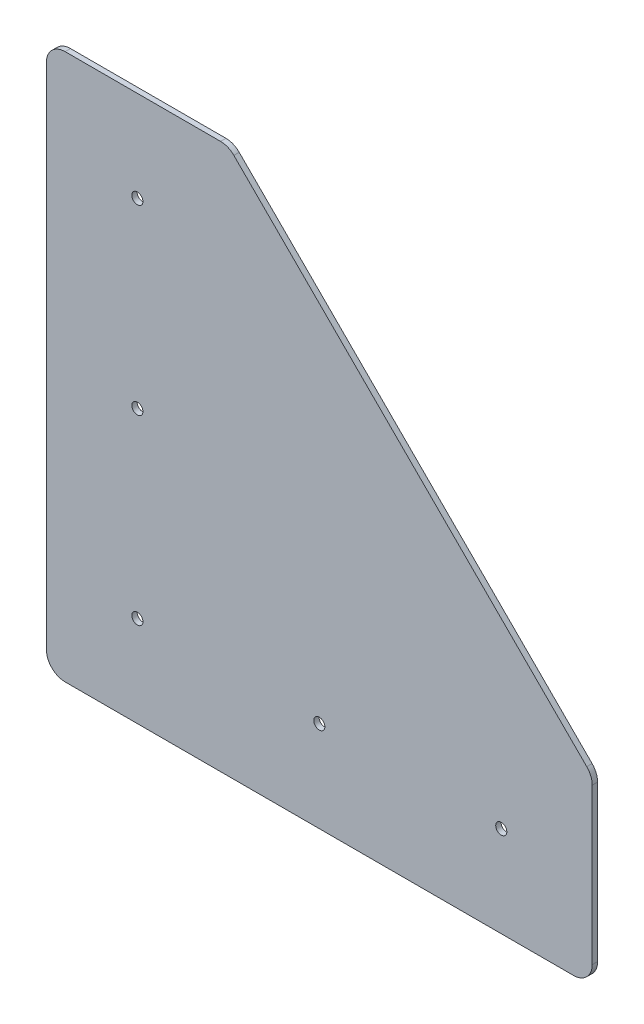
ISO-10303-21;
HEADER;
FILE_DESCRIPTION(('STEP AP214'),'2;1');
FILE_NAME('part.step','',(''),(''),'','','');
FILE_SCHEMA(('AUTOMOTIVE_DESIGN { 1 0 10303 214 1 1 1 1 }'));
ENDSEC;
DATA;
#1=APPLICATION_CONTEXT('core data for automotive mechanical design processes');
#2=APPLICATION_PROTOCOL_DEFINITION('international standard','automotive_design',2000,#1);
#3=PRODUCT_CONTEXT('',#1,'mechanical');
#4=PRODUCT('Part','Part','',(#3));
#5=PRODUCT_RELATED_PRODUCT_CATEGORY('part','',(#4));
#6=PRODUCT_DEFINITION_FORMATION('','',#4);
#7=PRODUCT_DEFINITION_CONTEXT('part definition',#1,'design');
#8=PRODUCT_DEFINITION('design','',#6,#7);
#9=PRODUCT_DEFINITION_SHAPE('','',#8);
#10=(LENGTH_UNIT() NAMED_UNIT(*) SI_UNIT(.MILLI.,.METRE.));
#11=(NAMED_UNIT(*) PLANE_ANGLE_UNIT() SI_UNIT($,.RADIAN.));
#12=(NAMED_UNIT(*) SI_UNIT($,.STERADIAN.) SOLID_ANGLE_UNIT());
#13=UNCERTAINTY_MEASURE_WITH_UNIT(LENGTH_MEASURE(1.E-05),#10,'distance_accuracy_value','');
#14=(GEOMETRIC_REPRESENTATION_CONTEXT(3) GLOBAL_UNCERTAINTY_ASSIGNED_CONTEXT((#13)) GLOBAL_UNIT_ASSIGNED_CONTEXT((#10,
#11,#12)) REPRESENTATION_CONTEXT('',''));
#15=CARTESIAN_POINT('',(0.,0.,0.));
#16=DIRECTION('',(0.,0.,1.));
#17=DIRECTION('',(1.,0.,0.));
#18=AXIS2_PLACEMENT_3D('',#15,#16,#17);
#19=CARTESIAN_POINT('',(0.,5.55625,0.));
#20=DIRECTION('',(1.,0.,0.));
#21=DIRECTION('',(0.,1.,0.));
#22=AXIS2_PLACEMENT_3D('',#19,#20,#21);
#23=PLANE('',#22);
#24=DIRECTION('',(0.,0.,-1.));
#25=VECTOR('',#24,1.);
#26=CARTESIAN_POINT('',(0.,5.55624999900217,0.79375));
#27=LINE('',#26,#25);
#28=CARTESIAN_POINT('',(0.,5.55624999950109,0.));
#29=VERTEX_POINT('',#28);
#30=CARTESIAN_POINT('',(0.,5.55624999950109,1.5875));
#31=VERTEX_POINT('',#30);
#32=EDGE_CURVE('E141',#29,#31,#27,.F.);
#33=ORIENTED_EDGE('',*,*,#32,.T.);
#34=DIRECTION('',(0.,-1.,0.));
#35=VECTOR('',#34,1.);
#36=CARTESIAN_POINT('',(0.,80.9625,1.5875));
#37=LINE('',#36,#35);
#38=CARTESIAN_POINT('',(0.,156.36875,1.5875));
#39=VERTEX_POINT('',#38);
#40=EDGE_CURVE('E171',#39,#31,#37,.T.);
#41=ORIENTED_EDGE('',*,*,#40,.F.);
#42=DIRECTION('',(0.,0.,1.));
#43=VECTOR('',#42,1.);
#44=CARTESIAN_POINT('',(0.,156.36875,0.79375));
#45=LINE('',#44,#43);
#46=CARTESIAN_POINT('',(0.,156.36875,0.));
#47=VERTEX_POINT('',#46);
#48=EDGE_CURVE('E119',#39,#47,#45,.F.);
#49=ORIENTED_EDGE('',*,*,#48,.T.);
#50=DIRECTION('',(0.,-1.,0.));
#51=VECTOR('',#50,1.);
#52=CARTESIAN_POINT('',(0.,80.9625,0.));
#53=LINE('',#52,#51);
#54=EDGE_CURVE('E188',#47,#29,#53,.T.);
#55=ORIENTED_EDGE('',*,*,#54,.T.);
#56=EDGE_LOOP('',(#33,#41,#49,#55));
#57=FACE_BOUND('',#56,.T.);
#58=ADVANCED_FACE('F16',(#57),#23,.F.);
#59=CARTESIAN_POINT('',(5.55625,5.55625,1.5875));
#60=DIRECTION('',(0.,0.,-1.));
#61=DIRECTION('',(0.,1.,0.));
#62=AXIS2_PLACEMENT_3D('',#59,#60,#61);
#63=CYLINDRICAL_SURFACE('',#62,5.55625);
#64=ORIENTED_EDGE('',*,*,#32,.F.);
#65=CARTESIAN_POINT('',(5.55625,5.55625,0.));
#66=DIRECTION('',(0.,0.,-1.));
#67=DIRECTION('',(0.,1.,0.));
#68=AXIS2_PLACEMENT_3D('',#65,#66,#67);
#69=CIRCLE('',#68,5.55625);
#70=CARTESIAN_POINT('',(5.55625,0.,0.));
#71=VERTEX_POINT('',#70);
#72=EDGE_CURVE('E185',#29,#71,#69,.F.);
#73=ORIENTED_EDGE('',*,*,#72,.T.);
#74=DIRECTION('',(0.,0.,1.));
#75=VECTOR('',#74,1.);
#76=CARTESIAN_POINT('',(5.55625,0.,0.79375));
#77=LINE('',#76,#75);
#78=CARTESIAN_POINT('',(5.55625,0.,1.5875));
#79=VERTEX_POINT('',#78);
#80=EDGE_CURVE('E138',#71,#79,#77,.T.);
#81=ORIENTED_EDGE('',*,*,#80,.T.);
#82=CARTESIAN_POINT('',(5.55625,5.55625,1.5875));
#83=DIRECTION('',(0.,0.,-1.));
#84=DIRECTION('',(0.,1.,0.));
#85=AXIS2_PLACEMENT_3D('',#82,#83,#84);
#86=CIRCLE('',#85,5.55625);
#87=EDGE_CURVE('E169',#31,#79,#86,.F.);
#88=ORIENTED_EDGE('',*,*,#87,.F.);
#89=EDGE_LOOP('',(#64,#73,#81,#88));
#90=FACE_BOUND('',#89,.T.);
#91=ADVANCED_FACE('F263',(#90),#63,.T.);
#92=CARTESIAN_POINT('',(156.36875,0.,0.));
#93=DIRECTION('',(0.,1.,0.));
#94=DIRECTION('',(-1.,0.,0.));
#95=AXIS2_PLACEMENT_3D('',#92,#93,#94);
#96=PLANE('',#95);
#97=ORIENTED_EDGE('',*,*,#80,.F.);
#98=DIRECTION('',(1.,0.,0.));
#99=VECTOR('',#98,1.);
#100=CARTESIAN_POINT('',(80.9625,0.,0.));
#101=LINE('',#100,#99);
#102=CARTESIAN_POINT('',(156.368750001069,0.,0.));
#103=VERTEX_POINT('',#102);
#104=EDGE_CURVE('E184',#71,#103,#101,.T.);
#105=ORIENTED_EDGE('',*,*,#104,.T.);
#106=DIRECTION('',(0.,0.,-1.));
#107=VECTOR('',#106,1.);
#108=CARTESIAN_POINT('',(156.368750002137,0.,0.79375));
#109=LINE('',#108,#107);
#110=CARTESIAN_POINT('',(156.368750001069,0.,1.5875));
#111=VERTEX_POINT('',#110);
#112=EDGE_CURVE('E92',#103,#111,#109,.F.);
#113=ORIENTED_EDGE('',*,*,#112,.T.);
#114=DIRECTION('',(1.,0.,0.));
#115=VECTOR('',#114,1.);
#116=CARTESIAN_POINT('',(80.9625,0.,1.5875));
#117=LINE('',#116,#115);
#118=EDGE_CURVE('E168',#79,#111,#117,.T.);
#119=ORIENTED_EDGE('',*,*,#118,.F.);
#120=EDGE_LOOP('',(#97,#105,#113,#119));
#121=FACE_BOUND('',#120,.T.);
#122=ADVANCED_FACE('F262',(#121),#96,.F.);
#123=CARTESIAN_POINT('',(156.36875,5.55625,1.5875));
#124=DIRECTION('',(0.,0.,-1.));
#125=DIRECTION('',(0.,1.,0.));
#126=AXIS2_PLACEMENT_3D('',#123,#124,#125);
#127=CYLINDRICAL_SURFACE('',#126,5.55625000000001);
#128=ORIENTED_EDGE('',*,*,#112,.F.);
#129=CARTESIAN_POINT('',(156.36875,5.55625,0.));
#130=DIRECTION('',(0.,0.,-1.));
#131=DIRECTION('',(0.,1.,0.));
#132=AXIS2_PLACEMENT_3D('',#129,#130,#131);
#133=CIRCLE('',#132,5.55625000000001);
#134=CARTESIAN_POINT('',(161.925,5.55625,0.));
#135=VERTEX_POINT('',#134);
#136=EDGE_CURVE('E20',#103,#135,#133,.F.);
#137=ORIENTED_EDGE('',*,*,#136,.T.);
#138=DIRECTION('',(0.,0.,1.));
#139=VECTOR('',#138,1.);
#140=CARTESIAN_POINT('',(161.925,5.55625,0.79375));
#141=LINE('',#140,#139);
#142=CARTESIAN_POINT('',(161.925,5.55625,1.5875));
#143=VERTEX_POINT('',#142);
#144=EDGE_CURVE('E99',#135,#143,#141,.T.);
#145=ORIENTED_EDGE('',*,*,#144,.T.);
#146=CARTESIAN_POINT('',(156.36875,5.55625,1.5875));
#147=DIRECTION('',(0.,0.,-1.));
#148=DIRECTION('',(0.,1.,0.));
#149=AXIS2_PLACEMENT_3D('',#146,#147,#148);
#150=CIRCLE('',#149,5.55625000000001);
#151=EDGE_CURVE('E166',#111,#143,#150,.F.);
#152=ORIENTED_EDGE('',*,*,#151,.F.);
#153=EDGE_LOOP('',(#128,#137,#145,#152));
#154=FACE_BOUND('',#153,.T.);
#155=ADVANCED_FACE('F117',(#154),#127,.T.);
#156=CARTESIAN_POINT('',(161.925,5.55625,0.));
#157=DIRECTION('',(-1.,0.,0.));
#158=DIRECTION('',(0.,0.,1.));
#159=AXIS2_PLACEMENT_3D('',#156,#157,#158);
#160=PLANE('',#159);
#161=ORIENTED_EDGE('',*,*,#144,.F.);
#162=DIRECTION('',(0.,1.,0.));
#163=VECTOR('',#162,1.);
#164=CARTESIAN_POINT('',(161.925,80.9625,0.));
#165=LINE('',#164,#163);
#166=CARTESIAN_POINT('',(161.925,51.6735258870604,0.));
#167=VERTEX_POINT('',#166);
#168=EDGE_CURVE('E103',#135,#167,#165,.T.);
#169=ORIENTED_EDGE('',*,*,#168,.T.);
#170=DIRECTION('',(0.,0.,-1.));
#171=VECTOR('',#170,1.);
#172=CARTESIAN_POINT('',(161.925,51.6735258859208,0.79375));
#173=LINE('',#172,#171);
#174=CARTESIAN_POINT('',(161.925,51.6735258870604,1.5875));
#175=VERTEX_POINT('',#174);
#176=EDGE_CURVE('E105',#167,#175,#173,.F.);
#177=ORIENTED_EDGE('',*,*,#176,.T.);
#178=DIRECTION('',(0.,1.,0.));
#179=VECTOR('',#178,1.);
#180=CARTESIAN_POINT('',(161.925,80.9625,1.5875));
#181=LINE('',#180,#179);
#182=EDGE_CURVE('E104',#143,#175,#181,.T.);
#183=ORIENTED_EDGE('',*,*,#182,.F.);
#184=EDGE_LOOP('',(#161,#169,#177,#183));
#185=FACE_BOUND('',#184,.T.);
#186=ADVANCED_FACE('F101',(#185),#160,.F.);
#187=CARTESIAN_POINT('',(156.36875,51.6735258882,1.5875));
#188=DIRECTION('',(0.,0.,-1.));
#189=DIRECTION('',(0.,1.,0.));
#190=AXIS2_PLACEMENT_3D('',#187,#188,#189);
#191=CYLINDRICAL_SURFACE('',#190,5.55625000000001);
#192=ORIENTED_EDGE('',*,*,#176,.F.);
#193=CARTESIAN_POINT('',(156.36875,51.6735258882,0.));
#194=DIRECTION('',(0.,0.,-1.));
#195=DIRECTION('',(0.,1.,0.));
#196=AXIS2_PLACEMENT_3D('',#193,#194,#195);
#197=CIRCLE('',#196,5.55625000000001);
#198=CARTESIAN_POINT('',(160.29761204955,55.60238795045,0.));
#199=VERTEX_POINT('',#198);
#200=EDGE_CURVE('E115',#167,#199,#197,.F.);
#201=ORIENTED_EDGE('',*,*,#200,.T.);
#202=DIRECTION('',(0.,0.,1.));
#203=VECTOR('',#202,1.);
#204=CARTESIAN_POINT('',(160.2976120432,55.6023879568,0.79375));
#205=LINE('',#204,#203);
#206=CARTESIAN_POINT('',(160.297612036056,55.6023879369563,1.5875));
#207=VERTEX_POINT('',#206);
#208=EDGE_CURVE('E133',#199,#207,#205,.T.);
#209=ORIENTED_EDGE('',*,*,#208,.T.);
#210=CARTESIAN_POINT('',(156.36875,51.6735258882,1.5875));
#211=DIRECTION('',(0.,0.,-1.));
#212=DIRECTION('',(0.,1.,0.));
#213=AXIS2_PLACEMENT_3D('',#210,#211,#212);
#214=CIRCLE('',#213,5.55625000000001);
#215=EDGE_CURVE('E164',#175,#207,#214,.F.);
#216=ORIENTED_EDGE('',*,*,#215,.F.);
#217=EDGE_LOOP('',(#192,#201,#209,#216));
#218=FACE_BOUND('',#217,.T.);
#219=ADVANCED_FACE('F199',(#218),#191,.T.);
#220=CARTESIAN_POINT('',(55.6023879568,160.2976120432,0.));
#221=DIRECTION('',(-0.707106781186547,-0.707106781186547,0.));
#222=DIRECTION('',(0.707106781186547,-0.707106781186547,0.));
#223=AXIS2_PLACEMENT_3D('',#220,#221,#222);
#224=PLANE('',#223);
#225=ORIENTED_EDGE('',*,*,#208,.F.);
#226=DIRECTION('',(0.707106781186547,-0.707106781186547,0.));
#227=VECTOR('',#226,1.);
#228=CARTESIAN_POINT('',(55.6023879568,160.2976120432,0.));
#229=LINE('',#228,#227);
#230=CARTESIAN_POINT('',(55.602387942256,160.297612054812,0.));
#231=VERTEX_POINT('',#230);
#232=EDGE_CURVE('E196',#199,#231,#229,.F.);
#233=ORIENTED_EDGE('',*,*,#232,.T.);
#234=DIRECTION('',(0.,0.,-1.));
#235=VECTOR('',#234,1.);
#236=CARTESIAN_POINT('',(55.6023879404121,160.297612053723,0.79375));
#237=LINE('',#236,#235);
#238=CARTESIAN_POINT('',(55.6023879287623,160.297612041318,1.5875));
#239=VERTEX_POINT('',#238);
#240=EDGE_CURVE('E130',#231,#239,#237,.F.);
#241=ORIENTED_EDGE('',*,*,#240,.T.);
#242=DIRECTION('',(-0.707106781186548,0.707106781186548,0.));
#243=VECTOR('',#242,1.);
#244=CARTESIAN_POINT('',(160.29761197335,55.602387972675,1.5875));
#245=LINE('',#244,#243);
#246=EDGE_CURVE('E162',#207,#239,#245,.T.);
#247=ORIENTED_EDGE('',*,*,#246,.F.);
#248=EDGE_LOOP('',(#225,#233,#241,#247));
#249=FACE_BOUND('',#248,.T.);
#250=ADVANCED_FACE('F218',(#249),#224,.F.);
#251=CARTESIAN_POINT('',(51.6735258882,156.36875,1.5875));
#252=DIRECTION('',(0.,0.,-1.));
#253=DIRECTION('',(0.,1.,0.));
#254=AXIS2_PLACEMENT_3D('',#251,#252,#253);
#255=CYLINDRICAL_SURFACE('',#254,5.55625000000001);
#256=ORIENTED_EDGE('',*,*,#240,.F.);
#257=CARTESIAN_POINT('',(51.6735258882,156.36875,0.));
#258=DIRECTION('',(0.,0.,-1.));
#259=DIRECTION('',(0.,1.,0.));
#260=AXIS2_PLACEMENT_3D('',#257,#258,#259);
#261=CIRCLE('',#260,5.55625000000001);
#262=CARTESIAN_POINT('',(51.6735258882,161.925,0.));
#263=VERTEX_POINT('',#262);
#264=EDGE_CURVE('E193',#231,#263,#261,.F.);
#265=ORIENTED_EDGE('',*,*,#264,.T.);
#266=DIRECTION('',(0.,0.,1.));
#267=VECTOR('',#266,1.);
#268=CARTESIAN_POINT('',(51.6735258882,161.925,0.79375));
#269=LINE('',#268,#267);
#270=CARTESIAN_POINT('',(51.6735258882,161.925,1.5875));
#271=VERTEX_POINT('',#270);
#272=EDGE_CURVE('E124',#263,#271,#269,.T.);
#273=ORIENTED_EDGE('',*,*,#272,.T.);
#274=CARTESIAN_POINT('',(51.6735258882,156.36875,1.5875));
#275=DIRECTION('',(0.,0.,-1.));
#276=DIRECTION('',(0.,1.,0.));
#277=AXIS2_PLACEMENT_3D('',#274,#275,#276);
#278=CIRCLE('',#277,5.55625000000001);
#279=EDGE_CURVE('E160',#239,#271,#278,.F.);
#280=ORIENTED_EDGE('',*,*,#279,.F.);
#281=EDGE_LOOP('',(#256,#265,#273,#280));
#282=FACE_BOUND('',#281,.T.);
#283=ADVANCED_FACE('F215',(#282),#255,.T.);
#284=CARTESIAN_POINT('',(5.55625,161.925,1.5875));
#285=DIRECTION('',(0.,-1.,0.));
#286=DIRECTION('',(0.,0.,-1.));
#287=AXIS2_PLACEMENT_3D('',#284,#285,#286);
#288=PLANE('',#287);
#289=ORIENTED_EDGE('',*,*,#272,.F.);
#290=DIRECTION('',(-1.,0.,0.));
#291=VECTOR('',#290,1.);
#292=CARTESIAN_POINT('',(80.9625,161.925,0.));
#293=LINE('',#292,#291);
#294=CARTESIAN_POINT('',(5.5562500005698,161.925,0.));
#295=VERTEX_POINT('',#294);
#296=EDGE_CURVE('E192',#263,#295,#293,.T.);
#297=ORIENTED_EDGE('',*,*,#296,.T.);
#298=DIRECTION('',(0.,0.,-1.));
#299=VECTOR('',#298,1.);
#300=CARTESIAN_POINT('',(5.5562500011396,161.925,0.79375));
#301=LINE('',#300,#299);
#302=CARTESIAN_POINT('',(5.5562500005698,161.925,1.5875));
#303=VERTEX_POINT('',#302);
#304=EDGE_CURVE('E118',#295,#303,#301,.F.);
#305=ORIENTED_EDGE('',*,*,#304,.T.);
#306=DIRECTION('',(-1.,0.,0.));
#307=VECTOR('',#306,1.);
#308=CARTESIAN_POINT('',(80.9625,161.925,1.5875));
#309=LINE('',#308,#307);
#310=EDGE_CURVE('E35',#271,#303,#309,.T.);
#311=ORIENTED_EDGE('',*,*,#310,.F.);
#312=EDGE_LOOP('',(#289,#297,#305,#311));
#313=FACE_BOUND('',#312,.T.);
#314=ADVANCED_FACE('F210',(#313),#288,.F.);
#315=CARTESIAN_POINT('',(5.55625,156.36875,1.5875));
#316=DIRECTION('',(0.,0.,-1.));
#317=DIRECTION('',(0.,1.,0.));
#318=AXIS2_PLACEMENT_3D('',#315,#316,#317);
#319=CYLINDRICAL_SURFACE('',#318,5.55625);
#320=ORIENTED_EDGE('',*,*,#304,.F.);
#321=CARTESIAN_POINT('',(5.55625,156.36875,0.));
#322=DIRECTION('',(0.,0.,-1.));
#323=DIRECTION('',(0.,1.,0.));
#324=AXIS2_PLACEMENT_3D('',#321,#322,#323);
#325=CIRCLE('',#324,5.55625);
#326=EDGE_CURVE('E189',#295,#47,#325,.F.);
#327=ORIENTED_EDGE('',*,*,#326,.T.);
#328=ORIENTED_EDGE('',*,*,#48,.F.);
#329=CARTESIAN_POINT('',(5.55625,156.36875,1.5875));
#330=DIRECTION('',(0.,0.,-1.));
#331=DIRECTION('',(0.,1.,0.));
#332=AXIS2_PLACEMENT_3D('',#329,#330,#331);
#333=CIRCLE('',#332,5.55625);
#334=EDGE_CURVE('E158',#303,#39,#333,.F.);
#335=ORIENTED_EDGE('',*,*,#334,.F.);
#336=EDGE_LOOP('',(#320,#327,#328,#335));
#337=FACE_BOUND('',#336,.T.);
#338=ADVANCED_FACE('F255',(#337),#319,.T.);
#339=CARTESIAN_POINT('',(80.9625,26.9875,0.));
#340=DIRECTION('',(0.,0.,1.));
#341=DIRECTION('',(1.,0.,0.));
#342=AXIS2_PLACEMENT_3D('',#339,#340,#341);
#343=CYLINDRICAL_SURFACE('',#342,1.65099999999999);
#344=CARTESIAN_POINT('',(80.9625,26.9875,1.5875));
#345=DIRECTION('',(0.,0.,1.));
#346=DIRECTION('',(1.,0.,0.));
#347=AXIS2_PLACEMENT_3D('',#344,#345,#346);
#348=CIRCLE('',#347,1.65099999999999);
#349=CARTESIAN_POINT('',(82.6135,26.9875,1.5875));
#350=VERTEX_POINT('',#349);
#351=EDGE_CURVE('E155',#350,#350,#348,.F.);
#352=ORIENTED_EDGE('',*,*,#351,.F.);
#353=EDGE_LOOP('',(#352));
#354=FACE_BOUND('',#353,.T.);
#355=CARTESIAN_POINT('',(80.9625,26.9875,0.));
#356=DIRECTION('',(0.,0.,1.));
#357=DIRECTION('',(1.,0.,0.));
#358=AXIS2_PLACEMENT_3D('',#355,#356,#357);
#359=CIRCLE('',#358,1.65099999999999);
#360=CARTESIAN_POINT('',(82.6135,26.9875,0.));
#361=VERTEX_POINT('',#360);
#362=EDGE_CURVE('E181',#361,#361,#359,.F.);
#363=ORIENTED_EDGE('',*,*,#362,.T.);
#364=EDGE_LOOP('',(#363));
#365=FACE_BOUND('',#364,.T.);
#366=ADVANCED_FACE('F251',(#354,#365),#343,.F.);
#367=CARTESIAN_POINT('',(26.9875,26.9875,0.));
#368=DIRECTION('',(0.,0.,1.));
#369=DIRECTION('',(1.,0.,0.));
#370=AXIS2_PLACEMENT_3D('',#367,#368,#369);
#371=CYLINDRICAL_SURFACE('',#370,1.651);
#372=CARTESIAN_POINT('',(26.9875,26.9875,1.5875));
#373=DIRECTION('',(0.,0.,1.));
#374=DIRECTION('',(1.,0.,0.));
#375=AXIS2_PLACEMENT_3D('',#372,#373,#374);
#376=CIRCLE('',#375,1.651);
#377=CARTESIAN_POINT('',(28.6385,26.9875,1.5875));
#378=VERTEX_POINT('',#377);
#379=EDGE_CURVE('E152',#378,#378,#376,.F.);
#380=ORIENTED_EDGE('',*,*,#379,.F.);
#381=EDGE_LOOP('',(#380));
#382=FACE_BOUND('',#381,.T.);
#383=CARTESIAN_POINT('',(26.9875,26.9875,0.));
#384=DIRECTION('',(0.,0.,1.));
#385=DIRECTION('',(1.,0.,0.));
#386=AXIS2_PLACEMENT_3D('',#383,#384,#385);
#387=CIRCLE('',#386,1.651);
#388=CARTESIAN_POINT('',(28.6385,26.9875,0.));
#389=VERTEX_POINT('',#388);
#390=EDGE_CURVE('E178',#389,#389,#387,.F.);
#391=ORIENTED_EDGE('',*,*,#390,.T.);
#392=EDGE_LOOP('',(#391));
#393=FACE_BOUND('',#392,.T.);
#394=ADVANCED_FACE('F247',(#382,#393),#371,.F.);
#395=CARTESIAN_POINT('',(26.9875,80.9625,0.));
#396=DIRECTION('',(0.,0.,1.));
#397=DIRECTION('',(1.,0.,0.));
#398=AXIS2_PLACEMENT_3D('',#395,#396,#397);
#399=CYLINDRICAL_SURFACE('',#398,1.651);
#400=CARTESIAN_POINT('',(26.9875,80.9625,1.5875));
#401=DIRECTION('',(0.,0.,1.));
#402=DIRECTION('',(1.,0.,0.));
#403=AXIS2_PLACEMENT_3D('',#400,#401,#402);
#404=CIRCLE('',#403,1.651);
#405=CARTESIAN_POINT('',(28.6385,80.9625,1.5875));
#406=VERTEX_POINT('',#405);
#407=EDGE_CURVE('E149',#406,#406,#404,.F.);
#408=ORIENTED_EDGE('',*,*,#407,.F.);
#409=EDGE_LOOP('',(#408));
#410=FACE_BOUND('',#409,.T.);
#411=CARTESIAN_POINT('',(26.9875,80.9625,0.));
#412=DIRECTION('',(0.,0.,1.));
#413=DIRECTION('',(1.,0.,0.));
#414=AXIS2_PLACEMENT_3D('',#411,#412,#413);
#415=CIRCLE('',#414,1.651);
#416=CARTESIAN_POINT('',(28.6385,80.9625,0.));
#417=VERTEX_POINT('',#416);
#418=EDGE_CURVE('E175',#417,#417,#415,.F.);
#419=ORIENTED_EDGE('',*,*,#418,.T.);
#420=EDGE_LOOP('',(#419));
#421=FACE_BOUND('',#420,.T.);
#422=ADVANCED_FACE('F243',(#410,#421),#399,.F.);
#423=CARTESIAN_POINT('',(26.9875,134.9375,0.));
#424=DIRECTION('',(0.,0.,1.));
#425=DIRECTION('',(1.,0.,0.));
#426=AXIS2_PLACEMENT_3D('',#423,#424,#425);
#427=CYLINDRICAL_SURFACE('',#426,1.651);
#428=CARTESIAN_POINT('',(26.9875,134.9375,1.5875));
#429=DIRECTION('',(0.,0.,1.));
#430=DIRECTION('',(1.,0.,0.));
#431=AXIS2_PLACEMENT_3D('',#428,#429,#430);
#432=CIRCLE('',#431,1.651);
#433=CARTESIAN_POINT('',(28.6385,134.9375,1.5875));
#434=VERTEX_POINT('',#433);
#435=EDGE_CURVE('E146',#434,#434,#432,.F.);
#436=ORIENTED_EDGE('',*,*,#435,.F.);
#437=EDGE_LOOP('',(#436));
#438=FACE_BOUND('',#437,.T.);
#439=CARTESIAN_POINT('',(26.9875,134.9375,0.));
#440=DIRECTION('',(0.,0.,1.));
#441=DIRECTION('',(1.,0.,0.));
#442=AXIS2_PLACEMENT_3D('',#439,#440,#441);
#443=CIRCLE('',#442,1.651);
#444=CARTESIAN_POINT('',(28.6385,134.9375,0.));
#445=VERTEX_POINT('',#444);
#446=EDGE_CURVE('E172',#445,#445,#443,.F.);
#447=ORIENTED_EDGE('',*,*,#446,.T.);
#448=EDGE_LOOP('',(#447));
#449=FACE_BOUND('',#448,.T.);
#450=ADVANCED_FACE('F240',(#438,#449),#427,.F.);
#451=CARTESIAN_POINT('',(0.,0.,0.));
#452=DIRECTION('',(0.,0.,1.));
#453=DIRECTION('',(1.,0.,0.));
#454=AXIS2_PLACEMENT_3D('',#451,#452,#453);
#455=PLANE('',#454);
#456=ORIENTED_EDGE('',*,*,#446,.F.);
#457=EDGE_LOOP('',(#456));
#458=FACE_BOUND('',#457,.T.);
#459=ORIENTED_EDGE('',*,*,#418,.F.);
#460=EDGE_LOOP('',(#459));
#461=FACE_BOUND('',#460,.T.);
#462=ORIENTED_EDGE('',*,*,#390,.F.);
#463=EDGE_LOOP('',(#462));
#464=FACE_BOUND('',#463,.T.);
#465=ORIENTED_EDGE('',*,*,#362,.F.);
#466=EDGE_LOOP('',(#465));
#467=FACE_BOUND('',#466,.T.);
#468=CARTESIAN_POINT('',(134.9375,26.9875,0.));
#469=DIRECTION('',(0.,0.,1.));
#470=DIRECTION('',(1.,0.,0.));
#471=AXIS2_PLACEMENT_3D('',#468,#469,#470);
#472=CIRCLE('',#471,1.65100000000001);
#473=CARTESIAN_POINT('',(136.5885,26.9875,0.));
#474=VERTEX_POINT('',#473);
#475=EDGE_CURVE('E26',#474,#474,#472,.F.);
#476=ORIENTED_EDGE('',*,*,#475,.F.);
#477=EDGE_LOOP('',(#476));
#478=FACE_BOUND('',#477,.T.);
#479=ORIENTED_EDGE('',*,*,#72,.F.);
#480=ORIENTED_EDGE('',*,*,#54,.F.);
#481=ORIENTED_EDGE('',*,*,#326,.F.);
#482=ORIENTED_EDGE('',*,*,#296,.F.);
#483=ORIENTED_EDGE('',*,*,#264,.F.);
#484=ORIENTED_EDGE('',*,*,#232,.F.);
#485=ORIENTED_EDGE('',*,*,#200,.F.);
#486=ORIENTED_EDGE('',*,*,#168,.F.);
#487=ORIENTED_EDGE('',*,*,#136,.F.);
#488=ORIENTED_EDGE('',*,*,#104,.F.);
#489=EDGE_LOOP('',(#479,#480,#481,#482,#483,#484,#485,#486,#487,#488));
#490=FACE_BOUND('',#489,.T.);
#491=ADVANCED_FACE('F110',(#458,#461,#464,#467,#478,#490),#455,.F.);
#492=CARTESIAN_POINT('',(0.,0.,1.5875));
#493=DIRECTION('',(0.,0.,1.));
#494=DIRECTION('',(1.,0.,0.));
#495=AXIS2_PLACEMENT_3D('',#492,#493,#494);
#496=PLANE('',#495);
#497=ORIENTED_EDGE('',*,*,#435,.T.);
#498=EDGE_LOOP('',(#497));
#499=FACE_BOUND('',#498,.T.);
#500=ORIENTED_EDGE('',*,*,#407,.T.);
#501=EDGE_LOOP('',(#500));
#502=FACE_BOUND('',#501,.T.);
#503=ORIENTED_EDGE('',*,*,#379,.T.);
#504=EDGE_LOOP('',(#503));
#505=FACE_BOUND('',#504,.T.);
#506=ORIENTED_EDGE('',*,*,#351,.T.);
#507=EDGE_LOOP('',(#506));
#508=FACE_BOUND('',#507,.T.);
#509=CARTESIAN_POINT('',(134.9375,26.9875,1.5875));
#510=DIRECTION('',(0.,0.,1.));
#511=DIRECTION('',(1.,0.,0.));
#512=AXIS2_PLACEMENT_3D('',#509,#510,#511);
#513=CIRCLE('',#512,1.65100000000001);
#514=CARTESIAN_POINT('',(136.5885,26.9875,1.5875));
#515=VERTEX_POINT('',#514);
#516=EDGE_CURVE('E11',#515,#515,#513,.T.);
#517=ORIENTED_EDGE('',*,*,#516,.F.);
#518=EDGE_LOOP('',(#517));
#519=FACE_BOUND('',#518,.T.);
#520=ORIENTED_EDGE('',*,*,#310,.T.);
#521=ORIENTED_EDGE('',*,*,#334,.T.);
#522=ORIENTED_EDGE('',*,*,#40,.T.);
#523=ORIENTED_EDGE('',*,*,#87,.T.);
#524=ORIENTED_EDGE('',*,*,#118,.T.);
#525=ORIENTED_EDGE('',*,*,#151,.T.);
#526=ORIENTED_EDGE('',*,*,#182,.T.);
#527=ORIENTED_EDGE('',*,*,#215,.T.);
#528=ORIENTED_EDGE('',*,*,#246,.T.);
#529=ORIENTED_EDGE('',*,*,#279,.T.);
#530=EDGE_LOOP('',(#520,#521,#522,#523,#524,#525,#526,#527,#528,#529));
#531=FACE_BOUND('',#530,.T.);
#532=ADVANCED_FACE('F18',(#499,#502,#505,#508,#519,#531),#496,.T.);
#533=CARTESIAN_POINT('',(134.9375,26.9875,0.));
#534=DIRECTION('',(0.,0.,1.));
#535=DIRECTION('',(1.,0.,0.));
#536=AXIS2_PLACEMENT_3D('',#533,#534,#535);
#537=CYLINDRICAL_SURFACE('',#536,1.65100000000001);
#538=ORIENTED_EDGE('',*,*,#475,.T.);
#539=EDGE_LOOP('',(#538));
#540=FACE_BOUND('',#539,.T.);
#541=ORIENTED_EDGE('',*,*,#516,.T.);
#542=EDGE_LOOP('',(#541));
#543=FACE_BOUND('',#542,.T.);
#544=ADVANCED_FACE('F230',(#540,#543),#537,.F.);
#545=CLOSED_SHELL('',(#58,#91,#122,#155,#186,#219,#250,#283,#314,#338,#366,#394,#422,#450,#491,
#532,#544));
#546=MANIFOLD_SOLID_BREP('B1',#545);
#547=ADVANCED_BREP_SHAPE_REPRESENTATION('',(#18,#546),#14);
#548=SHAPE_DEFINITION_REPRESENTATION(#9,#547);
ENDSEC;
END-ISO-10303-21;
